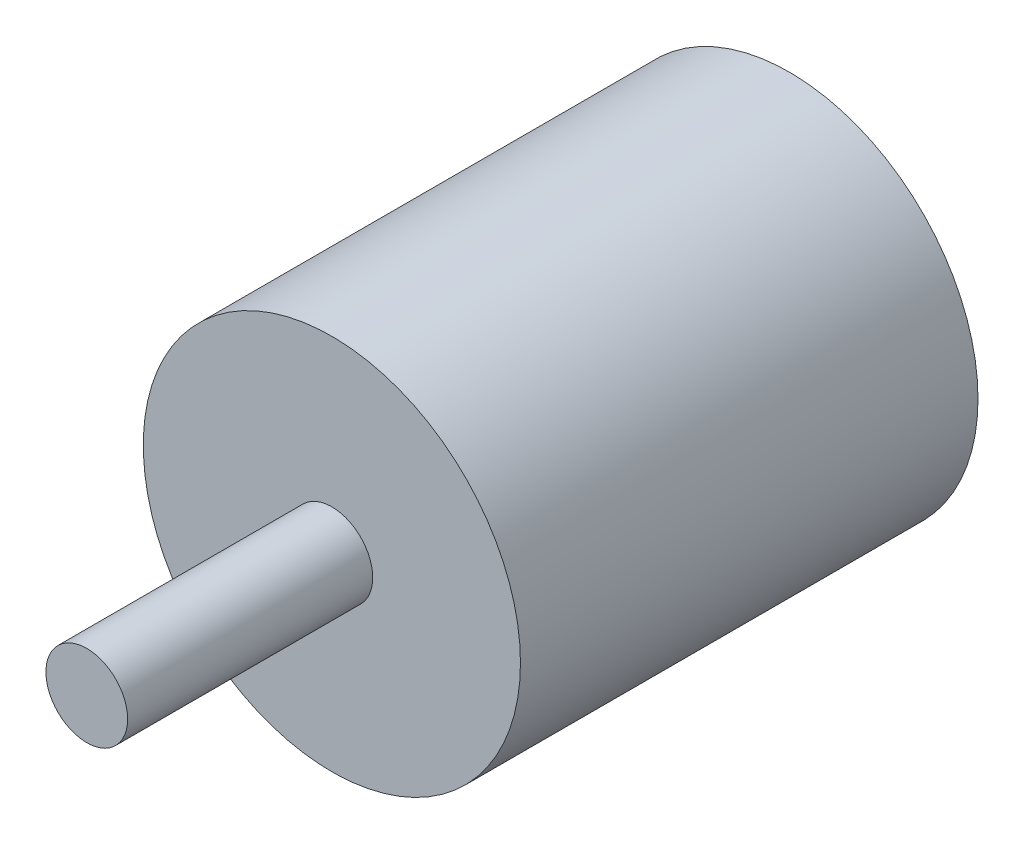
ISO-10303-21;
HEADER;
FILE_DESCRIPTION(('STEP AP214'),'2;1');
FILE_NAME('part.step','',(''),(''),'','','');
FILE_SCHEMA(('AUTOMOTIVE_DESIGN { 1 0 10303 214 1 1 1 1 }'));
ENDSEC;
DATA;
#1=APPLICATION_CONTEXT('core data for automotive mechanical design processes');
#2=APPLICATION_PROTOCOL_DEFINITION('international standard','automotive_design',2000,#1);
#3=PRODUCT_CONTEXT('',#1,'mechanical');
#4=PRODUCT('Part','Part','',(#3));
#5=PRODUCT_RELATED_PRODUCT_CATEGORY('part','',(#4));
#6=PRODUCT_DEFINITION_FORMATION('','',#4);
#7=PRODUCT_DEFINITION_CONTEXT('part definition',#1,'design');
#8=PRODUCT_DEFINITION('design','',#6,#7);
#9=PRODUCT_DEFINITION_SHAPE('','',#8);
#10=(LENGTH_UNIT() NAMED_UNIT(*) SI_UNIT(.MILLI.,.METRE.));
#11=(NAMED_UNIT(*) PLANE_ANGLE_UNIT() SI_UNIT($,.RADIAN.));
#12=(NAMED_UNIT(*) SI_UNIT($,.STERADIAN.) SOLID_ANGLE_UNIT());
#13=UNCERTAINTY_MEASURE_WITH_UNIT(LENGTH_MEASURE(1.E-05),#10,'distance_accuracy_value','');
#14=(GEOMETRIC_REPRESENTATION_CONTEXT(3) GLOBAL_UNCERTAINTY_ASSIGNED_CONTEXT((#13)) GLOBAL_UNIT_ASSIGNED_CONTEXT((#10,
#11,#12)) REPRESENTATION_CONTEXT('',''));
#15=CARTESIAN_POINT('',(0.,0.,0.));
#16=DIRECTION('',(0.,0.,1.));
#17=DIRECTION('',(1.,0.,0.));
#18=AXIS2_PLACEMENT_3D('',#15,#16,#17);
#19=CARTESIAN_POINT('',(0.,0.,33.6));
#20=DIRECTION('',(0.,0.,-1.));
#21=DIRECTION('',(-1.,0.,0.));
#22=AXIS2_PLACEMENT_3D('',#19,#20,#21);
#23=CYLINDRICAL_SURFACE('',#22,13.85);
#24=CARTESIAN_POINT('',(0.,0.,33.6));
#25=DIRECTION('',(0.,0.,1.));
#26=DIRECTION('',(1.,0.,0.));
#27=AXIS2_PLACEMENT_3D('',#24,#25,#26);
#28=CIRCLE('',#27,13.85);
#29=CARTESIAN_POINT('',(13.85,0.,33.6));
#30=VERTEX_POINT('',#29);
#31=EDGE_CURVE('E41',#30,#30,#28,.T.);
#32=ORIENTED_EDGE('',*,*,#31,.F.);
#33=EDGE_LOOP('',(#32));
#34=FACE_BOUND('',#33,.T.);
#35=CARTESIAN_POINT('',(0.,0.,0.));
#36=DIRECTION('',(0.,0.,1.));
#37=DIRECTION('',(1.,0.,0.));
#38=AXIS2_PLACEMENT_3D('',#35,#36,#37);
#39=CIRCLE('',#38,13.85);
#40=CARTESIAN_POINT('',(13.85,0.,0.));
#41=VERTEX_POINT('',#40);
#42=EDGE_CURVE('E37',#41,#41,#39,.T.);
#43=ORIENTED_EDGE('',*,*,#42,.T.);
#44=EDGE_LOOP('',(#43));
#45=FACE_BOUND('',#44,.T.);
#46=ADVANCED_FACE('F34',(#34,#45),#23,.T.);
#47=CARTESIAN_POINT('',(0.,0.,33.6));
#48=DIRECTION('',(0.,0.,1.));
#49=DIRECTION('',(1.,0.,0.));
#50=AXIS2_PLACEMENT_3D('',#47,#48,#49);
#51=PLANE('',#50);
#52=CARTESIAN_POINT('',(0.,0.,33.6));
#53=DIRECTION('',(0.,0.,1.));
#54=DIRECTION('',(1.,0.,0.));
#55=AXIS2_PLACEMENT_3D('',#52,#53,#54);
#56=CIRCLE('',#55,3.);
#57=CARTESIAN_POINT('',(3.,0.,33.6));
#58=VERTEX_POINT('',#57);
#59=EDGE_CURVE('E10',#58,#58,#56,.T.);
#60=ORIENTED_EDGE('',*,*,#59,.F.);
#61=EDGE_LOOP('',(#60));
#62=FACE_BOUND('',#61,.T.);
#63=ORIENTED_EDGE('',*,*,#31,.T.);
#64=EDGE_LOOP('',(#63));
#65=FACE_BOUND('',#64,.T.);
#66=ADVANCED_FACE('F88',(#62,#65),#51,.T.);
#67=CARTESIAN_POINT('',(0.,0.,0.));
#68=DIRECTION('',(0.,0.,1.));
#69=DIRECTION('',(1.,0.,0.));
#70=AXIS2_PLACEMENT_3D('',#67,#68,#69);
#71=PLANE('',#70);
#72=CARTESIAN_POINT('',(0.,7.59333333333333,0.));
#73=DIRECTION('',(0.,0.,-1.));
#74=DIRECTION('',(-1.,0.,0.));
#75=AXIS2_PLACEMENT_3D('',#72,#73,#74);
#76=CIRCLE('',#75,1.52666666666667);
#77=CARTESIAN_POINT('',(-1.52666666666667,7.59333333333333,0.));
#78=VERTEX_POINT('',#77);
#79=EDGE_CURVE('E69',#78,#78,#76,.T.);
#80=ORIENTED_EDGE('',*,*,#79,.F.);
#81=EDGE_LOOP('',(#80));
#82=FACE_BOUND('',#81,.T.);
#83=CARTESIAN_POINT('',(0.,-7.59333333333333,0.));
#84=DIRECTION('',(0.,0.,-1.));
#85=DIRECTION('',(-1.,0.,0.));
#86=AXIS2_PLACEMENT_3D('',#83,#84,#85);
#87=CIRCLE('',#86,1.52666666666667);
#88=CARTESIAN_POINT('',(-1.52666666666667,-7.59333333333333,0.));
#89=VERTEX_POINT('',#88);
#90=EDGE_CURVE('E63',#89,#89,#87,.T.);
#91=ORIENTED_EDGE('',*,*,#90,.F.);
#92=EDGE_LOOP('',(#91));
#93=FACE_BOUND('',#92,.T.);
#94=CARTESIAN_POINT('',(-9.515,0.,0.));
#95=DIRECTION('',(0.,0.,-1.));
#96=DIRECTION('',(-1.,0.,0.));
#97=AXIS2_PLACEMENT_3D('',#94,#95,#96);
#98=CIRCLE('',#97,1.215);
#99=CARTESIAN_POINT('',(-10.73,0.,0.));
#100=VERTEX_POINT('',#99);
#101=EDGE_CURVE('E57',#100,#100,#98,.T.);
#102=ORIENTED_EDGE('',*,*,#101,.F.);
#103=EDGE_LOOP('',(#102));
#104=FACE_BOUND('',#103,.T.);
#105=CARTESIAN_POINT('',(9.515,0.,0.));
#106=DIRECTION('',(0.,0.,-1.));
#107=DIRECTION('',(-1.,0.,0.));
#108=AXIS2_PLACEMENT_3D('',#105,#106,#107);
#109=CIRCLE('',#108,1.215);
#110=CARTESIAN_POINT('',(8.3,0.,0.));
#111=VERTEX_POINT('',#110);
#112=EDGE_CURVE('E51',#111,#111,#109,.T.);
#113=ORIENTED_EDGE('',*,*,#112,.F.);
#114=EDGE_LOOP('',(#113));
#115=FACE_BOUND('',#114,.T.);
#116=ORIENTED_EDGE('',*,*,#42,.F.);
#117=EDGE_LOOP('',(#116));
#118=FACE_BOUND('',#117,.T.);
#119=ADVANCED_FACE('F84',(#82,#93,#104,#115,#118),#71,.F.);
#120=CARTESIAN_POINT('',(0.,0.,51.6));
#121=DIRECTION('',(0.,0.,-1.));
#122=DIRECTION('',(-1.,0.,0.));
#123=AXIS2_PLACEMENT_3D('',#120,#121,#122);
#124=CYLINDRICAL_SURFACE('',#123,3.);
#125=CARTESIAN_POINT('',(0.,0.,51.6));
#126=DIRECTION('',(0.,0.,1.));
#127=DIRECTION('',(1.,0.,0.));
#128=AXIS2_PLACEMENT_3D('',#125,#126,#127);
#129=CIRCLE('',#128,3.);
#130=CARTESIAN_POINT('',(3.,0.,51.6));
#131=VERTEX_POINT('',#130);
#132=EDGE_CURVE('E47',#131,#131,#129,.T.);
#133=ORIENTED_EDGE('',*,*,#132,.F.);
#134=EDGE_LOOP('',(#133));
#135=FACE_BOUND('',#134,.T.);
#136=ORIENTED_EDGE('',*,*,#59,.T.);
#137=EDGE_LOOP('',(#136));
#138=FACE_BOUND('',#137,.T.);
#139=ADVANCED_FACE('F87',(#135,#138),#124,.T.);
#140=CARTESIAN_POINT('',(0.,0.,51.6));
#141=DIRECTION('',(0.,0.,1.));
#142=DIRECTION('',(1.,0.,0.));
#143=AXIS2_PLACEMENT_3D('',#140,#141,#142);
#144=PLANE('',#143);
#145=ORIENTED_EDGE('',*,*,#132,.T.);
#146=EDGE_LOOP('',(#145));
#147=FACE_BOUND('',#146,.T.);
#148=ADVANCED_FACE('F112',(#147),#144,.T.);
#149=CARTESIAN_POINT('',(9.515,0.,8.));
#150=DIRECTION('',(0.,0.,-1.));
#151=DIRECTION('',(-1.,0.,0.));
#152=AXIS2_PLACEMENT_3D('',#149,#150,#151);
#153=CYLINDRICAL_SURFACE('',#152,1.215);
#154=CARTESIAN_POINT('',(9.515,0.,8.));
#155=DIRECTION('',(0.,0.,-1.));
#156=DIRECTION('',(-1.,0.,0.));
#157=AXIS2_PLACEMENT_3D('',#154,#155,#156);
#158=CIRCLE('',#157,1.215);
#159=CARTESIAN_POINT('',(8.3,0.,8.));
#160=VERTEX_POINT('',#159);
#161=EDGE_CURVE('E54',#160,#160,#158,.T.);
#162=ORIENTED_EDGE('',*,*,#161,.F.);
#163=EDGE_LOOP('',(#162));
#164=FACE_BOUND('',#163,.T.);
#165=ORIENTED_EDGE('',*,*,#112,.T.);
#166=EDGE_LOOP('',(#165));
#167=FACE_BOUND('',#166,.T.);
#168=ADVANCED_FACE('F116',(#164,#167),#153,.F.);
#169=CARTESIAN_POINT('',(0.,0.,8.));
#170=DIRECTION('',(0.,0.,-1.));
#171=DIRECTION('',(-1.,0.,0.));
#172=AXIS2_PLACEMENT_3D('',#169,#170,#171);
#173=PLANE('',#172);
#174=ORIENTED_EDGE('',*,*,#161,.T.);
#175=EDGE_LOOP('',(#174));
#176=FACE_BOUND('',#175,.T.);
#177=ADVANCED_FACE('F120',(#176),#173,.T.);
#178=CARTESIAN_POINT('',(-9.515,0.,8.));
#179=DIRECTION('',(0.,0.,-1.));
#180=DIRECTION('',(-1.,0.,0.));
#181=AXIS2_PLACEMENT_3D('',#178,#179,#180);
#182=CYLINDRICAL_SURFACE('',#181,1.215);
#183=CARTESIAN_POINT('',(-9.515,0.,8.));
#184=DIRECTION('',(0.,0.,-1.));
#185=DIRECTION('',(-1.,0.,0.));
#186=AXIS2_PLACEMENT_3D('',#183,#184,#185);
#187=CIRCLE('',#186,1.215);
#188=CARTESIAN_POINT('',(-10.73,0.,8.));
#189=VERTEX_POINT('',#188);
#190=EDGE_CURVE('E60',#189,#189,#187,.T.);
#191=ORIENTED_EDGE('',*,*,#190,.F.);
#192=EDGE_LOOP('',(#191));
#193=FACE_BOUND('',#192,.T.);
#194=ORIENTED_EDGE('',*,*,#101,.T.);
#195=EDGE_LOOP('',(#194));
#196=FACE_BOUND('',#195,.T.);
#197=ADVANCED_FACE('F124',(#193,#196),#182,.F.);
#198=CARTESIAN_POINT('',(0.,0.,8.));
#199=DIRECTION('',(0.,0.,-1.));
#200=DIRECTION('',(-1.,0.,0.));
#201=AXIS2_PLACEMENT_3D('',#198,#199,#200);
#202=PLANE('',#201);
#203=ORIENTED_EDGE('',*,*,#190,.T.);
#204=EDGE_LOOP('',(#203));
#205=FACE_BOUND('',#204,.T.);
#206=ADVANCED_FACE('F128',(#205),#202,.T.);
#207=CARTESIAN_POINT('',(0.,-7.59333333333333,8.));
#208=DIRECTION('',(0.,0.,-1.));
#209=DIRECTION('',(-1.,0.,0.));
#210=AXIS2_PLACEMENT_3D('',#207,#208,#209);
#211=CYLINDRICAL_SURFACE('',#210,1.52666666666667);
#212=CARTESIAN_POINT('',(0.,-7.59333333333333,8.));
#213=DIRECTION('',(0.,0.,-1.));
#214=DIRECTION('',(-1.,0.,0.));
#215=AXIS2_PLACEMENT_3D('',#212,#213,#214);
#216=CIRCLE('',#215,1.52666666666667);
#217=CARTESIAN_POINT('',(-1.52666666666667,-7.59333333333333,8.));
#218=VERTEX_POINT('',#217);
#219=EDGE_CURVE('E66',#218,#218,#216,.T.);
#220=ORIENTED_EDGE('',*,*,#219,.F.);
#221=EDGE_LOOP('',(#220));
#222=FACE_BOUND('',#221,.T.);
#223=ORIENTED_EDGE('',*,*,#90,.T.);
#224=EDGE_LOOP('',(#223));
#225=FACE_BOUND('',#224,.T.);
#226=ADVANCED_FACE('F132',(#222,#225),#211,.F.);
#227=CARTESIAN_POINT('',(0.,0.,8.));
#228=DIRECTION('',(0.,0.,-1.));
#229=DIRECTION('',(-1.,0.,0.));
#230=AXIS2_PLACEMENT_3D('',#227,#228,#229);
#231=PLANE('',#230);
#232=ORIENTED_EDGE('',*,*,#219,.T.);
#233=EDGE_LOOP('',(#232));
#234=FACE_BOUND('',#233,.T.);
#235=ADVANCED_FACE('F80',(#234),#231,.T.);
#236=CARTESIAN_POINT('',(0.,7.59333333333333,8.));
#237=DIRECTION('',(0.,0.,-1.));
#238=DIRECTION('',(-1.,0.,0.));
#239=AXIS2_PLACEMENT_3D('',#236,#237,#238);
#240=CYLINDRICAL_SURFACE('',#239,1.52666666666667);
#241=CARTESIAN_POINT('',(0.,7.59333333333333,8.));
#242=DIRECTION('',(0.,0.,-1.));
#243=DIRECTION('',(-1.,0.,0.));
#244=AXIS2_PLACEMENT_3D('',#241,#242,#243);
#245=CIRCLE('',#244,1.52666666666667);
#246=CARTESIAN_POINT('',(-1.52666666666667,7.59333333333333,8.));
#247=VERTEX_POINT('',#246);
#248=EDGE_CURVE('E50',#247,#247,#245,.T.);
#249=ORIENTED_EDGE('',*,*,#248,.F.);
#250=EDGE_LOOP('',(#249));
#251=FACE_BOUND('',#250,.T.);
#252=ORIENTED_EDGE('',*,*,#79,.T.);
#253=EDGE_LOOP('',(#252));
#254=FACE_BOUND('',#253,.T.);
#255=ADVANCED_FACE('F77',(#251,#254),#240,.F.);
#256=CARTESIAN_POINT('',(0.,0.,8.));
#257=DIRECTION('',(0.,0.,-1.));
#258=DIRECTION('',(-1.,0.,0.));
#259=AXIS2_PLACEMENT_3D('',#256,#257,#258);
#260=PLANE('',#259);
#261=ORIENTED_EDGE('',*,*,#248,.T.);
#262=EDGE_LOOP('',(#261));
#263=FACE_BOUND('',#262,.T.);
#264=ADVANCED_FACE('F75',(#263),#260,.T.);
#265=CLOSED_SHELL('',(#46,#66,#119,#139,#148,#168,#177,#197,#206,#226,#235,#255,#264));
#266=MANIFOLD_SOLID_BREP('B2',#265);
#267=ADVANCED_BREP_SHAPE_REPRESENTATION('',(#18,#266),#14);
#268=SHAPE_DEFINITION_REPRESENTATION(#9,#267);
ENDSEC;
END-ISO-10303-21;
